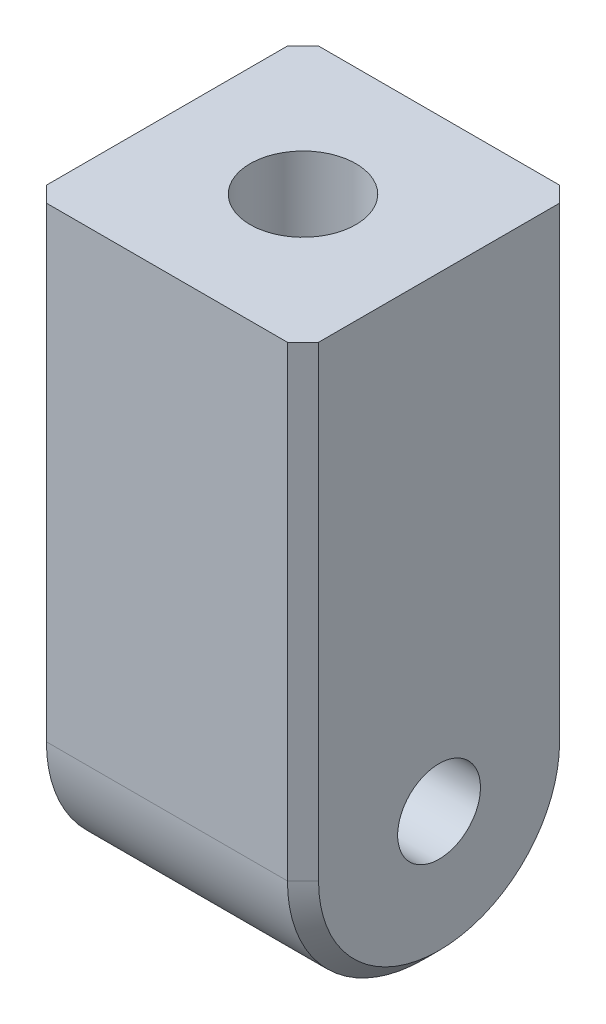
ISO-10303-21;
HEADER;
FILE_DESCRIPTION(('STEP AP214'),'2;1');
FILE_NAME('part.step','',(''),(''),'','','');
FILE_SCHEMA(('AUTOMOTIVE_DESIGN { 1 0 10303 214 1 1 1 1 }'));
ENDSEC;
DATA;
#1=APPLICATION_CONTEXT('core data for automotive mechanical design processes');
#2=APPLICATION_PROTOCOL_DEFINITION('international standard','automotive_design',2000,#1);
#3=PRODUCT_CONTEXT('',#1,'mechanical');
#4=PRODUCT('Part','Part','',(#3));
#5=PRODUCT_RELATED_PRODUCT_CATEGORY('part','',(#4));
#6=PRODUCT_DEFINITION_FORMATION('','',#4);
#7=PRODUCT_DEFINITION_CONTEXT('part definition',#1,'design');
#8=PRODUCT_DEFINITION('design','',#6,#7);
#9=PRODUCT_DEFINITION_SHAPE('','',#8);
#10=(LENGTH_UNIT() NAMED_UNIT(*) SI_UNIT(.MILLI.,.METRE.));
#11=(NAMED_UNIT(*) PLANE_ANGLE_UNIT() SI_UNIT($,.RADIAN.));
#12=(NAMED_UNIT(*) SI_UNIT($,.STERADIAN.) SOLID_ANGLE_UNIT());
#13=UNCERTAINTY_MEASURE_WITH_UNIT(LENGTH_MEASURE(1.E-05),#10,'distance_accuracy_value','');
#14=(GEOMETRIC_REPRESENTATION_CONTEXT(3) GLOBAL_UNCERTAINTY_ASSIGNED_CONTEXT((#13)) GLOBAL_UNIT_ASSIGNED_CONTEXT((#10,
#11,#12)) REPRESENTATION_CONTEXT('',''));
#15=CARTESIAN_POINT('',(0.,0.,0.));
#16=DIRECTION('',(0.,0.,1.));
#17=DIRECTION('',(1.,0.,0.));
#18=AXIS2_PLACEMENT_3D('',#15,#16,#17);
#19=CARTESIAN_POINT('',(4.445,19.685,4.445));
#20=DIRECTION('',(-1.,0.,0.));
#21=DIRECTION('',(0.,0.,1.));
#22=AXIS2_PLACEMENT_3D('',#19,#20,#21);
#23=PLANE('',#22);
#24=CARTESIAN_POINT('',(4.445,4.445,0.));
#25=DIRECTION('',(1.,0.,0.));
#26=DIRECTION('',(0.,0.,-1.));
#27=AXIS2_PLACEMENT_3D('',#24,#25,#26);
#28=CIRCLE('',#27,1.35255);
#29=CARTESIAN_POINT('',(4.445,4.445,-1.35255));
#30=VERTEX_POINT('',#29);
#31=EDGE_CURVE('E204',#30,#30,#28,.T.);
#32=ORIENTED_EDGE('',*,*,#31,.F.);
#33=EDGE_LOOP('',(#32));
#34=FACE_BOUND('',#33,.T.);
#35=CARTESIAN_POINT('',(4.445,4.445,0.));
#36=DIRECTION('',(-1.,0.,0.));
#37=DIRECTION('',(0.,0.,1.));
#38=AXIS2_PLACEMENT_3D('',#35,#36,#37);
#39=CIRCLE('',#38,3.937);
#40=CARTESIAN_POINT('',(4.445,0.507999999999998,0.));
#41=VERTEX_POINT('',#40);
#42=CARTESIAN_POINT('',(4.445,4.445,-3.937));
#43=VERTEX_POINT('',#42);
#44=EDGE_CURVE('E52',#41,#43,#39,.F.);
#45=ORIENTED_EDGE('',*,*,#44,.T.);
#46=DIRECTION('',(0.,1.,0.));
#47=VECTOR('',#46,1.);
#48=CARTESIAN_POINT('',(4.445,19.685,-3.937));
#49=LINE('',#48,#47);
#50=CARTESIAN_POINT('',(4.445,19.685,-3.937));
#51=VERTEX_POINT('',#50);
#52=EDGE_CURVE('E11',#43,#51,#49,.T.);
#53=ORIENTED_EDGE('',*,*,#52,.T.);
#54=DIRECTION('',(0.,0.,-1.));
#55=VECTOR('',#54,1.);
#56=CARTESIAN_POINT('',(4.445,19.685,4.445));
#57=LINE('',#56,#55);
#58=CARTESIAN_POINT('',(4.445,19.685,3.937));
#59=VERTEX_POINT('',#58);
#60=EDGE_CURVE('E134',#59,#51,#57,.T.);
#61=ORIENTED_EDGE('',*,*,#60,.F.);
#62=DIRECTION('',(0.,-1.,0.));
#63=VECTOR('',#62,1.);
#64=CARTESIAN_POINT('',(4.445,19.685,3.937));
#65=LINE('',#64,#63);
#66=CARTESIAN_POINT('',(4.445,4.445,3.937));
#67=VERTEX_POINT('',#66);
#68=EDGE_CURVE('E192',#59,#67,#65,.T.);
#69=ORIENTED_EDGE('',*,*,#68,.T.);
#70=CARTESIAN_POINT('',(4.445,4.445,0.));
#71=DIRECTION('',(-1.,0.,0.));
#72=DIRECTION('',(0.,0.,1.));
#73=AXIS2_PLACEMENT_3D('',#70,#71,#72);
#74=CIRCLE('',#73,3.937);
#75=EDGE_CURVE('E63',#67,#41,#74,.F.);
#76=ORIENTED_EDGE('',*,*,#75,.T.);
#77=EDGE_LOOP('',(#45,#53,#61,#69,#76));
#78=FACE_BOUND('',#77,.T.);
#79=ADVANCED_FACE('F42',(#34,#78),#23,.F.);
#80=CARTESIAN_POINT('',(-4.445,19.685,-4.445));
#81=DIRECTION('',(0.,0.,1.));
#82=DIRECTION('',(1.,0.,0.));
#83=AXIS2_PLACEMENT_3D('',#80,#81,#82);
#84=PLANE('',#83);
#85=DIRECTION('',(-1.,0.,0.));
#86=VECTOR('',#85,1.);
#87=CARTESIAN_POINT('',(-4.445,4.445,-4.445));
#88=LINE('',#87,#86);
#89=CARTESIAN_POINT('',(3.937,4.445,-4.445));
#90=VERTEX_POINT('',#89);
#91=CARTESIAN_POINT('',(-3.937,4.445,-4.445));
#92=VERTEX_POINT('',#91);
#93=EDGE_CURVE('E152',#90,#92,#88,.T.);
#94=ORIENTED_EDGE('',*,*,#93,.T.);
#95=DIRECTION('',(0.,1.,0.));
#96=VECTOR('',#95,1.);
#97=CARTESIAN_POINT('',(-3.937,19.685,-4.445));
#98=LINE('',#97,#96);
#99=CARTESIAN_POINT('',(-3.937,19.685,-4.445));
#100=VERTEX_POINT('',#99);
#101=EDGE_CURVE('E190',#92,#100,#98,.T.);
#102=ORIENTED_EDGE('',*,*,#101,.T.);
#103=DIRECTION('',(-1.,0.,0.));
#104=VECTOR('',#103,1.);
#105=CARTESIAN_POINT('',(-4.445,19.685,-4.445));
#106=LINE('',#105,#104);
#107=CARTESIAN_POINT('',(3.937,19.685,-4.445));
#108=VERTEX_POINT('',#107);
#109=EDGE_CURVE('E143',#108,#100,#106,.T.);
#110=ORIENTED_EDGE('',*,*,#109,.F.);
#111=DIRECTION('',(0.,-1.,0.));
#112=VECTOR('',#111,1.);
#113=CARTESIAN_POINT('',(3.937,19.685,-4.445));
#114=LINE('',#113,#112);
#115=EDGE_CURVE('E187',#108,#90,#114,.T.);
#116=ORIENTED_EDGE('',*,*,#115,.T.);
#117=EDGE_LOOP('',(#94,#102,#110,#116));
#118=FACE_BOUND('',#117,.T.);
#119=ADVANCED_FACE('F257',(#118),#84,.F.);
#120=CARTESIAN_POINT('',(-4.445,19.685,4.445));
#121=DIRECTION('',(1.,0.,0.));
#122=DIRECTION('',(0.,0.,-1.));
#123=AXIS2_PLACEMENT_3D('',#120,#121,#122);
#124=PLANE('',#123);
#125=CARTESIAN_POINT('',(-4.445,4.445,0.));
#126=DIRECTION('',(1.,0.,0.));
#127=DIRECTION('',(0.,0.,-1.));
#128=AXIS2_PLACEMENT_3D('',#125,#126,#127);
#129=CIRCLE('',#128,1.35255);
#130=CARTESIAN_POINT('',(-4.445,4.445,-1.35255));
#131=VERTEX_POINT('',#130);
#132=EDGE_CURVE('E137',#131,#131,#129,.T.);
#133=ORIENTED_EDGE('',*,*,#132,.T.);
#134=EDGE_LOOP('',(#133));
#135=FACE_BOUND('',#134,.T.);
#136=CARTESIAN_POINT('',(-4.445,4.445,0.));
#137=DIRECTION('',(1.,0.,0.));
#138=DIRECTION('',(0.,0.,-1.));
#139=AXIS2_PLACEMENT_3D('',#136,#137,#138);
#140=CIRCLE('',#139,3.937);
#141=CARTESIAN_POINT('',(-4.445,0.507999999999998,0.));
#142=VERTEX_POINT('',#141);
#143=CARTESIAN_POINT('',(-4.445,4.445,3.937));
#144=VERTEX_POINT('',#143);
#145=EDGE_CURVE('E167',#142,#144,#140,.F.);
#146=ORIENTED_EDGE('',*,*,#145,.T.);
#147=DIRECTION('',(0.,1.,0.));
#148=VECTOR('',#147,1.);
#149=CARTESIAN_POINT('',(-4.445,19.685,3.937));
#150=LINE('',#149,#148);
#151=CARTESIAN_POINT('',(-4.445,19.685,3.937));
#152=VERTEX_POINT('',#151);
#153=EDGE_CURVE('E169',#144,#152,#150,.T.);
#154=ORIENTED_EDGE('',*,*,#153,.T.);
#155=DIRECTION('',(0.,0.,1.));
#156=VECTOR('',#155,1.);
#157=CARTESIAN_POINT('',(-4.445,19.685,4.445));
#158=LINE('',#157,#156);
#159=CARTESIAN_POINT('',(-4.445,19.685,-3.937));
#160=VERTEX_POINT('',#159);
#161=EDGE_CURVE('E146',#160,#152,#158,.T.);
#162=ORIENTED_EDGE('',*,*,#161,.F.);
#163=DIRECTION('',(0.,-1.,0.));
#164=VECTOR('',#163,1.);
#165=CARTESIAN_POINT('',(-4.445,19.685,-3.937));
#166=LINE('',#165,#164);
#167=CARTESIAN_POINT('',(-4.445,4.445,-3.937));
#168=VERTEX_POINT('',#167);
#169=EDGE_CURVE('E163',#160,#168,#166,.T.);
#170=ORIENTED_EDGE('',*,*,#169,.T.);
#171=CARTESIAN_POINT('',(-4.445,4.445,0.));
#172=DIRECTION('',(1.,0.,0.));
#173=DIRECTION('',(0.,0.,-1.));
#174=AXIS2_PLACEMENT_3D('',#171,#172,#173);
#175=CIRCLE('',#174,3.937);
#176=EDGE_CURVE('E165',#168,#142,#175,.F.);
#177=ORIENTED_EDGE('',*,*,#176,.T.);
#178=EDGE_LOOP('',(#146,#154,#162,#170,#177));
#179=FACE_BOUND('',#178,.T.);
#180=ADVANCED_FACE('F249',(#135,#179),#124,.F.);
#181=CARTESIAN_POINT('',(-4.445,19.685,4.445));
#182=DIRECTION('',(0.,0.,-1.));
#183=DIRECTION('',(-1.,0.,0.));
#184=AXIS2_PLACEMENT_3D('',#181,#182,#183);
#185=PLANE('',#184);
#186=DIRECTION('',(1.,0.,0.));
#187=VECTOR('',#186,1.);
#188=CARTESIAN_POINT('',(-4.445,19.685,4.445));
#189=LINE('',#188,#187);
#190=CARTESIAN_POINT('',(-3.937,19.685,4.445));
#191=VERTEX_POINT('',#190);
#192=CARTESIAN_POINT('',(3.937,19.685,4.445));
#193=VERTEX_POINT('',#192);
#194=EDGE_CURVE('E149',#191,#193,#189,.T.);
#195=ORIENTED_EDGE('',*,*,#194,.F.);
#196=DIRECTION('',(0.,-1.,0.));
#197=VECTOR('',#196,1.);
#198=CARTESIAN_POINT('',(-3.937,19.685,4.445));
#199=LINE('',#198,#197);
#200=CARTESIAN_POINT('',(-3.937,4.445,4.445));
#201=VERTEX_POINT('',#200);
#202=EDGE_CURVE('E160',#191,#201,#199,.T.);
#203=ORIENTED_EDGE('',*,*,#202,.T.);
#204=DIRECTION('',(1.,0.,0.));
#205=VECTOR('',#204,1.);
#206=CARTESIAN_POINT('',(4.445,4.445,4.445));
#207=LINE('',#206,#205);
#208=CARTESIAN_POINT('',(3.937,4.445,4.445));
#209=VERTEX_POINT('',#208);
#210=EDGE_CURVE('E155',#201,#209,#207,.T.);
#211=ORIENTED_EDGE('',*,*,#210,.T.);
#212=DIRECTION('',(0.,1.,0.));
#213=VECTOR('',#212,1.);
#214=CARTESIAN_POINT('',(3.937,19.685,4.445));
#215=LINE('',#214,#213);
#216=EDGE_CURVE('E157',#209,#193,#215,.T.);
#217=ORIENTED_EDGE('',*,*,#216,.T.);
#218=EDGE_LOOP('',(#195,#203,#211,#217));
#219=FACE_BOUND('',#218,.T.);
#220=ADVANCED_FACE('F221',(#219),#185,.F.);
#221=CARTESIAN_POINT('',(0.,19.685,0.));
#222=DIRECTION('',(0.,-1.,0.));
#223=DIRECTION('',(0.,0.,-1.));
#224=AXIS2_PLACEMENT_3D('',#221,#222,#223);
#225=PLANE('',#224);
#226=CARTESIAN_POINT('',(0.,19.685,0.));
#227=DIRECTION('',(0.,1.,0.));
#228=DIRECTION('',(0.,0.,1.));
#229=AXIS2_PLACEMENT_3D('',#226,#227,#228);
#230=CIRCLE('',#229,1.7272);
#231=CARTESIAN_POINT('',(0.,19.685,1.7272));
#232=VERTEX_POINT('',#231);
#233=EDGE_CURVE('E131',#232,#232,#230,.T.);
#234=ORIENTED_EDGE('',*,*,#233,.F.);
#235=EDGE_LOOP('',(#234));
#236=FACE_BOUND('',#235,.T.);
#237=ORIENTED_EDGE('',*,*,#161,.T.);
#238=DIRECTION('',(-0.70710678118655,0.,-0.707106781186545));
#239=VECTOR('',#238,1.);
#240=CARTESIAN_POINT('',(-3.937,19.685,4.445));
#241=LINE('',#240,#239);
#242=EDGE_CURVE('E177',#152,#191,#241,.F.);
#243=ORIENTED_EDGE('',*,*,#242,.T.);
#244=ORIENTED_EDGE('',*,*,#194,.T.);
#245=DIRECTION('',(-0.70710678118655,0.,0.707106781186545));
#246=VECTOR('',#245,1.);
#247=CARTESIAN_POINT('',(4.445,19.685,3.937));
#248=LINE('',#247,#246);
#249=EDGE_CURVE('E171',#193,#59,#248,.F.);
#250=ORIENTED_EDGE('',*,*,#249,.T.);
#251=ORIENTED_EDGE('',*,*,#60,.T.);
#252=DIRECTION('',(0.70710678118655,0.,0.707106781186545));
#253=VECTOR('',#252,1.);
#254=CARTESIAN_POINT('',(3.937,19.685,-4.445));
#255=LINE('',#254,#253);
#256=EDGE_CURVE('E173',#51,#108,#255,.F.);
#257=ORIENTED_EDGE('',*,*,#256,.T.);
#258=ORIENTED_EDGE('',*,*,#109,.T.);
#259=DIRECTION('',(0.70710678118655,0.,-0.707106781186545));
#260=VECTOR('',#259,1.);
#261=CARTESIAN_POINT('',(-4.445,19.685,-3.937));
#262=LINE('',#261,#260);
#263=EDGE_CURVE('E175',#100,#160,#262,.F.);
#264=ORIENTED_EDGE('',*,*,#263,.T.);
#265=EDGE_LOOP('',(#237,#243,#244,#250,#251,#257,#258,#264));
#266=FACE_BOUND('',#265,.T.);
#267=ADVANCED_FACE('F225',(#236,#266),#225,.F.);
#268=CARTESIAN_POINT('',(-4.445,4.445,0.));
#269=DIRECTION('',(-1.,0.,0.));
#270=DIRECTION('',(0.,0.,1.));
#271=AXIS2_PLACEMENT_3D('',#268,#269,#270);
#272=CYLINDRICAL_SURFACE('',#271,4.445);
#273=ORIENTED_EDGE('',*,*,#210,.F.);
#274=CARTESIAN_POINT('',(-3.937,4.445,0.));
#275=DIRECTION('',(1.,0.,0.));
#276=DIRECTION('',(0.,0.,-1.));
#277=AXIS2_PLACEMENT_3D('',#274,#275,#276);
#278=CIRCLE('',#277,4.445);
#279=CARTESIAN_POINT('',(-3.937,0.,0.));
#280=VERTEX_POINT('',#279);
#281=EDGE_CURVE('E181',#201,#280,#278,.T.);
#282=ORIENTED_EDGE('',*,*,#281,.T.);
#283=DIRECTION('',(1.,0.,0.));
#284=VECTOR('',#283,1.);
#285=CARTESIAN_POINT('',(-4.445,0.,0.));
#286=LINE('',#285,#284);
#287=CARTESIAN_POINT('',(3.937,0.,0.));
#288=VERTEX_POINT('',#287);
#289=EDGE_CURVE('E130',#288,#280,#286,.F.);
#290=ORIENTED_EDGE('',*,*,#289,.F.);
#291=CARTESIAN_POINT('',(3.937,4.445,0.));
#292=DIRECTION('',(-1.,0.,0.));
#293=DIRECTION('',(0.,0.,1.));
#294=AXIS2_PLACEMENT_3D('',#291,#292,#293);
#295=CIRCLE('',#294,4.445);
#296=EDGE_CURVE('E179',#288,#209,#295,.T.);
#297=ORIENTED_EDGE('',*,*,#296,.T.);
#298=EDGE_LOOP('',(#273,#282,#290,#297));
#299=FACE_BOUND('',#298,.T.);
#300=ADVANCED_FACE('F235',(#299),#272,.T.);
#301=CARTESIAN_POINT('',(-4.445,4.445,0.));
#302=DIRECTION('',(1.,0.,0.));
#303=DIRECTION('',(0.,0.,-1.));
#304=AXIS2_PLACEMENT_3D('',#301,#302,#303);
#305=CYLINDRICAL_SURFACE('',#304,4.445);
#306=ORIENTED_EDGE('',*,*,#289,.T.);
#307=CARTESIAN_POINT('',(-3.937,4.445,0.));
#308=DIRECTION('',(1.,0.,0.));
#309=DIRECTION('',(0.,0.,-1.));
#310=AXIS2_PLACEMENT_3D('',#307,#308,#309);
#311=CIRCLE('',#310,4.445);
#312=EDGE_CURVE('E185',#280,#92,#311,.T.);
#313=ORIENTED_EDGE('',*,*,#312,.T.);
#314=ORIENTED_EDGE('',*,*,#93,.F.);
#315=CARTESIAN_POINT('',(3.937,4.445,0.));
#316=DIRECTION('',(-1.,0.,0.));
#317=DIRECTION('',(0.,0.,1.));
#318=AXIS2_PLACEMENT_3D('',#315,#316,#317);
#319=CIRCLE('',#318,4.445);
#320=EDGE_CURVE('E183',#90,#288,#319,.T.);
#321=ORIENTED_EDGE('',*,*,#320,.T.);
#322=EDGE_LOOP('',(#306,#313,#314,#321));
#323=FACE_BOUND('',#322,.T.);
#324=ADVANCED_FACE('F124',(#323),#305,.T.);
#325=CARTESIAN_POINT('',(0.,8.255,0.));
#326=DIRECTION('',(0.,1.,0.));
#327=DIRECTION('',(0.,0.,1.));
#328=AXIS2_PLACEMENT_3D('',#325,#326,#327);
#329=CONICAL_SURFACE('',#328,1.7272,1.02974425867665);
#330=CARTESIAN_POINT('',(0.,7.2171935388156,0.));
#331=VERTEX_POINT('',#330);
#332=VERTEX_LOOP('',#331);
#333=FACE_BOUND('',#332,.T.);
#334=CARTESIAN_POINT('',(0.,8.255,0.));
#335=DIRECTION('',(0.,1.,0.));
#336=DIRECTION('',(0.,0.,1.));
#337=AXIS2_PLACEMENT_3D('',#334,#335,#336);
#338=CIRCLE('',#337,1.7272);
#339=CARTESIAN_POINT('',(0.,8.255,1.7272));
#340=VERTEX_POINT('',#339);
#341=EDGE_CURVE('E128',#340,#340,#338,.T.);
#342=ORIENTED_EDGE('',*,*,#341,.T.);
#343=EDGE_LOOP('',(#342));
#344=FACE_BOUND('',#343,.T.);
#345=ADVANCED_FACE('F120',(#333,#344),#329,.F.);
#346=CARTESIAN_POINT('',(0.,19.685,0.));
#347=DIRECTION('',(0.,1.,0.));
#348=DIRECTION('',(0.,0.,1.));
#349=AXIS2_PLACEMENT_3D('',#346,#347,#348);
#350=CYLINDRICAL_SURFACE('',#349,1.7272);
#351=ORIENTED_EDGE('',*,*,#341,.F.);
#352=EDGE_LOOP('',(#351));
#353=FACE_BOUND('',#352,.T.);
#354=ORIENTED_EDGE('',*,*,#233,.T.);
#355=EDGE_LOOP('',(#354));
#356=FACE_BOUND('',#355,.T.);
#357=ADVANCED_FACE('F123',(#353,#356),#350,.F.);
#358=CARTESIAN_POINT('',(4.445,4.445,0.));
#359=DIRECTION('',(1.,0.,0.));
#360=DIRECTION('',(0.,0.,-1.));
#361=AXIS2_PLACEMENT_3D('',#358,#359,#360);
#362=CYLINDRICAL_SURFACE('',#361,1.35255);
#363=ORIENTED_EDGE('',*,*,#132,.F.);
#364=EDGE_LOOP('',(#363));
#365=FACE_BOUND('',#364,.T.);
#366=ORIENTED_EDGE('',*,*,#31,.T.);
#367=EDGE_LOOP('',(#366));
#368=FACE_BOUND('',#367,.T.);
#369=ADVANCED_FACE('F305',(#365,#368),#362,.F.);
#370=CARTESIAN_POINT('',(-4.445,19.685,-3.937));
#371=DIRECTION('',(0.707106781186545,0.,0.70710678118655));
#372=DIRECTION('',(0.,-1.,0.));
#373=AXIS2_PLACEMENT_3D('',#370,#371,#372);
#374=PLANE('',#373);
#375=ORIENTED_EDGE('',*,*,#263,.F.);
#376=ORIENTED_EDGE('',*,*,#101,.F.);
#377=DIRECTION('',(0.70710678118655,0.,-0.707106781186545));
#378=VECTOR('',#377,1.);
#379=CARTESIAN_POINT('',(-4.445,4.445,-3.937));
#380=LINE('',#379,#378);
#381=EDGE_CURVE('E201',#168,#92,#380,.T.);
#382=ORIENTED_EDGE('',*,*,#381,.F.);
#383=ORIENTED_EDGE('',*,*,#169,.F.);
#384=EDGE_LOOP('',(#375,#376,#382,#383));
#385=FACE_BOUND('',#384,.T.);
#386=ADVANCED_FACE('F254',(#385),#374,.F.);
#387=CARTESIAN_POINT('',(-4.445,4.445,0.));
#388=DIRECTION('',(1.,0.,0.));
#389=DIRECTION('',(0.,0.,-1.));
#390=AXIS2_PLACEMENT_3D('',#387,#388,#389);
#391=CONICAL_SURFACE('',#390,3.937,0.785398163397445);
#392=ORIENTED_EDGE('',*,*,#381,.T.);
#393=ORIENTED_EDGE('',*,*,#312,.F.);
#394=DIRECTION('',(0.70710678118655,-0.707106781186545,0.));
#395=VECTOR('',#394,1.);
#396=CARTESIAN_POINT('',(-4.445,0.507999999999998,0.));
#397=LINE('',#396,#395);
#398=EDGE_CURVE('E198',#142,#280,#397,.T.);
#399=ORIENTED_EDGE('',*,*,#398,.F.);
#400=ORIENTED_EDGE('',*,*,#176,.F.);
#401=EDGE_LOOP('',(#392,#393,#399,#400));
#402=FACE_BOUND('',#401,.T.);
#403=ADVANCED_FACE('F242',(#402),#391,.T.);
#404=CARTESIAN_POINT('',(-4.445,4.445,0.));
#405=DIRECTION('',(1.,0.,0.));
#406=DIRECTION('',(0.,0.,-1.));
#407=AXIS2_PLACEMENT_3D('',#404,#405,#406);
#408=CONICAL_SURFACE('',#407,3.937,0.785398163397445);
#409=ORIENTED_EDGE('',*,*,#398,.T.);
#410=ORIENTED_EDGE('',*,*,#281,.F.);
#411=DIRECTION('',(0.70710678118655,0.,0.707106781186545));
#412=VECTOR('',#411,1.);
#413=CARTESIAN_POINT('',(-4.445,4.445,3.937));
#414=LINE('',#413,#412);
#415=EDGE_CURVE('E196',#144,#201,#414,.T.);
#416=ORIENTED_EDGE('',*,*,#415,.F.);
#417=ORIENTED_EDGE('',*,*,#145,.F.);
#418=EDGE_LOOP('',(#409,#410,#416,#417));
#419=FACE_BOUND('',#418,.T.);
#420=ADVANCED_FACE('F247',(#419),#408,.T.);
#421=CARTESIAN_POINT('',(-3.937,19.685,4.445));
#422=DIRECTION('',(0.707106781186545,0.,-0.70710678118655));
#423=DIRECTION('',(0.,-1.,0.));
#424=AXIS2_PLACEMENT_3D('',#421,#422,#423);
#425=PLANE('',#424);
#426=ORIENTED_EDGE('',*,*,#242,.F.);
#427=ORIENTED_EDGE('',*,*,#153,.F.);
#428=ORIENTED_EDGE('',*,*,#415,.T.);
#429=ORIENTED_EDGE('',*,*,#202,.F.);
#430=EDGE_LOOP('',(#426,#427,#428,#429));
#431=FACE_BOUND('',#430,.T.);
#432=ADVANCED_FACE('F231',(#431),#425,.F.);
#433=CARTESIAN_POINT('',(4.445,19.685,3.937));
#434=DIRECTION('',(-0.707106781186545,0.,-0.70710678118655));
#435=DIRECTION('',(0.,-1.,0.));
#436=AXIS2_PLACEMENT_3D('',#433,#434,#435);
#437=PLANE('',#436);
#438=ORIENTED_EDGE('',*,*,#249,.F.);
#439=ORIENTED_EDGE('',*,*,#216,.F.);
#440=DIRECTION('',(-0.70710678118655,0.,0.707106781186545));
#441=VECTOR('',#440,1.);
#442=CARTESIAN_POINT('',(4.445,4.445,3.937));
#443=LINE('',#442,#441);
#444=EDGE_CURVE('E47',#67,#209,#443,.T.);
#445=ORIENTED_EDGE('',*,*,#444,.F.);
#446=ORIENTED_EDGE('',*,*,#68,.F.);
#447=EDGE_LOOP('',(#438,#439,#445,#446));
#448=FACE_BOUND('',#447,.T.);
#449=ADVANCED_FACE('F45',(#448),#437,.F.);
#450=CARTESIAN_POINT('',(4.445,4.445,0.));
#451=DIRECTION('',(-1.,0.,0.));
#452=DIRECTION('',(0.,0.,1.));
#453=AXIS2_PLACEMENT_3D('',#450,#451,#452);
#454=CONICAL_SURFACE('',#453,3.937,0.785398163397445);
#455=ORIENTED_EDGE('',*,*,#444,.T.);
#456=ORIENTED_EDGE('',*,*,#296,.F.);
#457=DIRECTION('',(-0.70710678118655,-0.707106781186545,0.));
#458=VECTOR('',#457,1.);
#459=CARTESIAN_POINT('',(4.445,0.507999999999998,0.));
#460=LINE('',#459,#458);
#461=EDGE_CURVE('E206',#41,#288,#460,.T.);
#462=ORIENTED_EDGE('',*,*,#461,.F.);
#463=ORIENTED_EDGE('',*,*,#75,.F.);
#464=EDGE_LOOP('',(#455,#456,#462,#463));
#465=FACE_BOUND('',#464,.T.);
#466=ADVANCED_FACE('F214',(#465),#454,.T.);
#467=CARTESIAN_POINT('',(4.445,4.445,0.));
#468=DIRECTION('',(-1.,0.,0.));
#469=DIRECTION('',(0.,0.,1.));
#470=AXIS2_PLACEMENT_3D('',#467,#468,#469);
#471=CONICAL_SURFACE('',#470,3.937,0.785398163397445);
#472=ORIENTED_EDGE('',*,*,#461,.T.);
#473=ORIENTED_EDGE('',*,*,#320,.F.);
#474=DIRECTION('',(-0.70710678118655,0.,-0.707106781186545));
#475=VECTOR('',#474,1.);
#476=CARTESIAN_POINT('',(4.445,4.445,-3.937));
#477=LINE('',#476,#475);
#478=EDGE_CURVE('E205',#43,#90,#477,.T.);
#479=ORIENTED_EDGE('',*,*,#478,.F.);
#480=ORIENTED_EDGE('',*,*,#44,.F.);
#481=EDGE_LOOP('',(#472,#473,#479,#480));
#482=FACE_BOUND('',#481,.T.);
#483=ADVANCED_FACE('F263',(#482),#471,.T.);
#484=CARTESIAN_POINT('',(3.937,19.685,-4.445));
#485=DIRECTION('',(-0.707106781186545,0.,0.70710678118655));
#486=DIRECTION('',(0.,-1.,0.));
#487=AXIS2_PLACEMENT_3D('',#484,#485,#486);
#488=PLANE('',#487);
#489=ORIENTED_EDGE('',*,*,#256,.F.);
#490=ORIENTED_EDGE('',*,*,#52,.F.);
#491=ORIENTED_EDGE('',*,*,#478,.T.);
#492=ORIENTED_EDGE('',*,*,#115,.F.);
#493=EDGE_LOOP('',(#489,#490,#491,#492));
#494=FACE_BOUND('',#493,.T.);
#495=ADVANCED_FACE('F261',(#494),#488,.F.);
#496=CLOSED_SHELL('',(#79,#119,#180,#220,#267,#300,#324,#345,#357,#369,#386,#403,#420,#432,#449,
#466,#483,#495));
#497=MANIFOLD_SOLID_BREP('B2',#496);
#498=ADVANCED_BREP_SHAPE_REPRESENTATION('',(#18,#497),#14);
#499=SHAPE_DEFINITION_REPRESENTATION(#9,#498);
ENDSEC;
END-ISO-10303-21;
